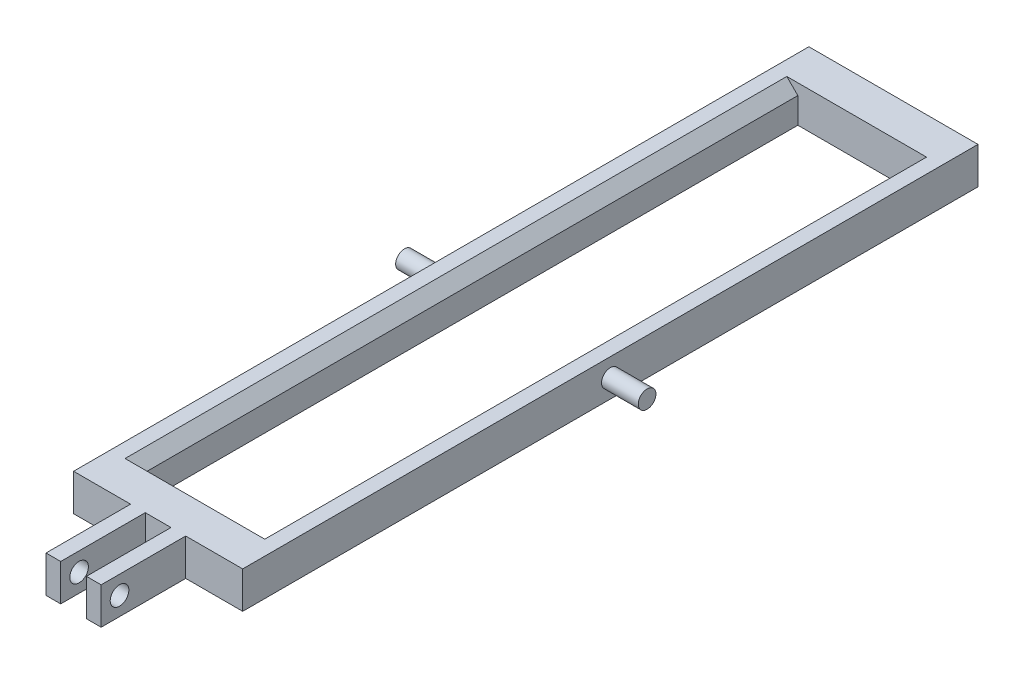
ISO-10303-21;
HEADER;
FILE_DESCRIPTION(('STEP AP214'),'2;1');
FILE_NAME('part.step','',(''),(''),'','','');
FILE_SCHEMA(('AUTOMOTIVE_DESIGN { 1 0 10303 214 1 1 1 1 }'));
ENDSEC;
DATA;
#1=APPLICATION_CONTEXT('core data for automotive mechanical design processes');
#2=APPLICATION_PROTOCOL_DEFINITION('international standard','automotive_design',2000,#1);
#3=PRODUCT_CONTEXT('',#1,'mechanical');
#4=PRODUCT('Part','Part','',(#3));
#5=PRODUCT_RELATED_PRODUCT_CATEGORY('part','',(#4));
#6=PRODUCT_DEFINITION_FORMATION('','',#4);
#7=PRODUCT_DEFINITION_CONTEXT('part definition',#1,'design');
#8=PRODUCT_DEFINITION('design','',#6,#7);
#9=PRODUCT_DEFINITION_SHAPE('','',#8);
#10=(LENGTH_UNIT() NAMED_UNIT(*) SI_UNIT(.MILLI.,.METRE.));
#11=(NAMED_UNIT(*) PLANE_ANGLE_UNIT() SI_UNIT($,.RADIAN.));
#12=(NAMED_UNIT(*) SI_UNIT($,.STERADIAN.) SOLID_ANGLE_UNIT());
#13=UNCERTAINTY_MEASURE_WITH_UNIT(LENGTH_MEASURE(1.E-05),#10,'distance_accuracy_value','');
#14=(GEOMETRIC_REPRESENTATION_CONTEXT(3) GLOBAL_UNCERTAINTY_ASSIGNED_CONTEXT((#13)) GLOBAL_UNIT_ASSIGNED_CONTEXT((#10,
#11,#12)) REPRESENTATION_CONTEXT('',''));
#15=CARTESIAN_POINT('',(0.,0.,0.));
#16=DIRECTION('',(0.,0.,1.));
#17=DIRECTION('',(1.,0.,0.));
#18=AXIS2_PLACEMENT_3D('',#15,#16,#17);
#19=CARTESIAN_POINT('',(0.,0.,200.));
#20=DIRECTION('',(0.,0.,-1.));
#21=DIRECTION('',(-1.,0.,0.));
#22=AXIS2_PLACEMENT_3D('',#19,#20,#21);
#23=PLANE('',#22);
#24=DIRECTION('',(0.,1.,0.));
#25=VECTOR('',#24,1.);
#26=CARTESIAN_POINT('',(19.5,0.,200.));
#27=LINE('',#26,#25);
#28=CARTESIAN_POINT('',(19.5,0.,200.));
#29=VERTEX_POINT('',#28);
#30=CARTESIAN_POINT('',(19.5,10.,200.));
#31=VERTEX_POINT('',#30);
#32=EDGE_CURVE('E58',#29,#31,#27,.T.);
#33=ORIENTED_EDGE('',*,*,#32,.F.);
#34=DIRECTION('',(1.,0.,0.));
#35=VECTOR('',#34,1.);
#36=CARTESIAN_POINT('',(46.,0.,200.));
#37=LINE('',#36,#35);
#38=CARTESIAN_POINT('',(26.5,0.,200.));
#39=VERTEX_POINT('',#38);
#40=EDGE_CURVE('E308',#29,#39,#37,.T.);
#41=ORIENTED_EDGE('',*,*,#40,.T.);
#42=DIRECTION('',(0.,-1.,0.));
#43=VECTOR('',#42,1.);
#44=CARTESIAN_POINT('',(26.5,0.,200.));
#45=LINE('',#44,#43);
#46=CARTESIAN_POINT('',(26.5,10.,200.));
#47=VERTEX_POINT('',#46);
#48=EDGE_CURVE('E51',#47,#39,#45,.T.);
#49=ORIENTED_EDGE('',*,*,#48,.F.);
#50=DIRECTION('',(-1.,0.,0.));
#51=VECTOR('',#50,1.);
#52=CARTESIAN_POINT('',(46.,10.,200.));
#53=LINE('',#52,#51);
#54=EDGE_CURVE('E304',#47,#31,#53,.T.);
#55=ORIENTED_EDGE('',*,*,#54,.T.);
#56=EDGE_LOOP('',(#33,#41,#49,#55));
#57=FACE_BOUND('',#56,.T.);
#58=ADVANCED_FACE('F43',(#57),#23,.F.);
#59=CARTESIAN_POINT('',(0.,0.,200.));
#60=VERTEX_POINT('',#59);
#61=CARTESIAN_POINT('',(15.5,0.,200.));
#62=VERTEX_POINT('',#61);
#63=EDGE_CURVE('E66',#60,#62,#37,.T.);
#64=ORIENTED_EDGE('',*,*,#63,.T.);
#65=DIRECTION('',(0.,1.,0.));
#66=VECTOR('',#65,1.);
#67=CARTESIAN_POINT('',(15.5,0.,200.));
#68=LINE('',#67,#66);
#69=CARTESIAN_POINT('',(15.5,10.,200.));
#70=VERTEX_POINT('',#69);
#71=EDGE_CURVE('E186',#62,#70,#68,.T.);
#72=ORIENTED_EDGE('',*,*,#71,.T.);
#73=CARTESIAN_POINT('',(0.,10.,200.));
#74=VERTEX_POINT('',#73);
#75=EDGE_CURVE('E291',#70,#74,#53,.T.);
#76=ORIENTED_EDGE('',*,*,#75,.T.);
#77=DIRECTION('',(0.,-1.,0.));
#78=VECTOR('',#77,1.);
#79=CARTESIAN_POINT('',(0.,57.0744091837593,200.));
#80=LINE('',#79,#78);
#81=EDGE_CURVE('E267',#74,#60,#80,.T.);
#82=ORIENTED_EDGE('',*,*,#81,.T.);
#83=EDGE_LOOP('',(#64,#72,#76,#82));
#84=FACE_BOUND('',#83,.T.);
#85=ADVANCED_FACE('F340',(#84),#23,.F.);
#86=CARTESIAN_POINT('',(42.,10.,200.));
#87=DIRECTION('',(0.707106781186553,-0.707106781186542,0.));
#88=DIRECTION('',(0.707106781186542,0.707106781186553,0.));
#89=AXIS2_PLACEMENT_3D('',#86,#87,#88);
#90=PLANE('',#89);
#91=DIRECTION('',(0.707106781186542,0.707106781186553,0.));
#92=VECTOR('',#91,1.);
#93=CARTESIAN_POINT('',(42.,10.,10.));
#94=LINE('',#93,#92);
#95=CARTESIAN_POINT('',(39.,6.99999999999997,10.));
#96=VERTEX_POINT('',#95);
#97=CARTESIAN_POINT('',(42.,10.,10.));
#98=VERTEX_POINT('',#97);
#99=EDGE_CURVE('E241',#96,#98,#94,.T.);
#100=ORIENTED_EDGE('',*,*,#99,.F.);
#101=DIRECTION('',(0.,0.,-1.));
#102=VECTOR('',#101,1.);
#103=CARTESIAN_POINT('',(39.,6.99999999999997,200.));
#104=LINE('',#103,#102);
#105=CARTESIAN_POINT('',(39.,6.99999999999997,190.));
#106=VERTEX_POINT('',#105);
#107=EDGE_CURVE('E286',#106,#96,#104,.T.);
#108=ORIENTED_EDGE('',*,*,#107,.F.);
#109=DIRECTION('',(0.707106781186542,0.707106781186553,0.));
#110=VECTOR('',#109,1.);
#111=CARTESIAN_POINT('',(42.,10.,190.));
#112=LINE('',#111,#110);
#113=CARTESIAN_POINT('',(42.,10.,190.));
#114=VERTEX_POINT('',#113);
#115=EDGE_CURVE('E274',#106,#114,#112,.T.);
#116=ORIENTED_EDGE('',*,*,#115,.T.);
#117=DIRECTION('',(0.,0.,-1.));
#118=VECTOR('',#117,1.);
#119=CARTESIAN_POINT('',(42.,10.,200.));
#120=LINE('',#119,#118);
#121=EDGE_CURVE('E284',#114,#98,#120,.T.);
#122=ORIENTED_EDGE('',*,*,#121,.T.);
#123=EDGE_LOOP('',(#100,#108,#116,#122));
#124=FACE_BOUND('',#123,.T.);
#125=ADVANCED_FACE('F365',(#124),#90,.F.);
#126=CARTESIAN_POINT('',(39.,0.,200.));
#127=DIRECTION('',(1.,0.,0.));
#128=DIRECTION('',(0.,1.,0.));
#129=AXIS2_PLACEMENT_3D('',#126,#127,#128);
#130=PLANE('',#129);
#131=DIRECTION('',(0.,1.,0.));
#132=VECTOR('',#131,1.);
#133=CARTESIAN_POINT('',(39.,0.,10.));
#134=LINE('',#133,#132);
#135=CARTESIAN_POINT('',(39.,0.,10.));
#136=VERTEX_POINT('',#135);
#137=EDGE_CURVE('E238',#136,#96,#134,.T.);
#138=ORIENTED_EDGE('',*,*,#137,.F.);
#139=DIRECTION('',(0.,0.,-1.));
#140=VECTOR('',#139,1.);
#141=CARTESIAN_POINT('',(39.,0.,200.));
#142=LINE('',#141,#140);
#143=CARTESIAN_POINT('',(39.,0.,190.));
#144=VERTEX_POINT('',#143);
#145=EDGE_CURVE('E288',#144,#136,#142,.T.);
#146=ORIENTED_EDGE('',*,*,#145,.F.);
#147=DIRECTION('',(0.,1.,0.));
#148=VECTOR('',#147,1.);
#149=CARTESIAN_POINT('',(39.,0.,190.));
#150=LINE('',#149,#148);
#151=EDGE_CURVE('E311',#144,#106,#150,.T.);
#152=ORIENTED_EDGE('',*,*,#151,.T.);
#153=ORIENTED_EDGE('',*,*,#107,.T.);
#154=EDGE_LOOP('',(#138,#146,#152,#153));
#155=FACE_BOUND('',#154,.T.);
#156=ADVANCED_FACE('F386',(#155),#130,.F.);
#157=CARTESIAN_POINT('',(7.,0.,200.));
#158=DIRECTION('',(-1.,0.,0.));
#159=DIRECTION('',(0.,0.,1.));
#160=AXIS2_PLACEMENT_3D('',#157,#158,#159);
#161=PLANE('',#160);
#162=DIRECTION('',(0.,-1.,0.));
#163=VECTOR('',#162,1.);
#164=CARTESIAN_POINT('',(7.,0.,10.));
#165=LINE('',#164,#163);
#166=CARTESIAN_POINT('',(7.,6.99999999999997,10.));
#167=VERTEX_POINT('',#166);
#168=CARTESIAN_POINT('',(7.,0.,10.));
#169=VERTEX_POINT('',#168);
#170=EDGE_CURVE('E234',#167,#169,#165,.T.);
#171=ORIENTED_EDGE('',*,*,#170,.F.);
#172=DIRECTION('',(0.,0.,-1.));
#173=VECTOR('',#172,1.);
#174=CARTESIAN_POINT('',(7.,6.99999999999997,200.));
#175=LINE('',#174,#173);
#176=CARTESIAN_POINT('',(7.,6.99999999999997,190.));
#177=VERTEX_POINT('',#176);
#178=EDGE_CURVE('E253',#177,#167,#175,.T.);
#179=ORIENTED_EDGE('',*,*,#178,.F.);
#180=DIRECTION('',(0.,1.,0.));
#181=VECTOR('',#180,1.);
#182=CARTESIAN_POINT('',(7.,57.0744091837593,190.));
#183=LINE('',#182,#181);
#184=CARTESIAN_POINT('',(7.,0.,190.));
#185=VERTEX_POINT('',#184);
#186=EDGE_CURVE('E317',#185,#177,#183,.T.);
#187=ORIENTED_EDGE('',*,*,#186,.F.);
#188=DIRECTION('',(0.,0.,-1.));
#189=VECTOR('',#188,1.);
#190=CARTESIAN_POINT('',(7.,0.,200.));
#191=LINE('',#190,#189);
#192=EDGE_CURVE('E256',#185,#169,#191,.T.);
#193=ORIENTED_EDGE('',*,*,#192,.T.);
#194=EDGE_LOOP('',(#171,#179,#187,#193));
#195=FACE_BOUND('',#194,.T.);
#196=ADVANCED_FACE('F389',(#195),#161,.F.);
#197=CARTESIAN_POINT('',(4.00000000000001,10.,200.));
#198=DIRECTION('',(-0.707106781186552,-0.707106781186543,0.));
#199=DIRECTION('',(0.707106781186543,-0.707106781186552,0.));
#200=AXIS2_PLACEMENT_3D('',#197,#198,#199);
#201=PLANE('',#200);
#202=DIRECTION('',(0.707106781186543,-0.707106781186552,0.));
#203=VECTOR('',#202,1.);
#204=CARTESIAN_POINT('',(4.00000000000001,10.,10.));
#205=LINE('',#204,#203);
#206=CARTESIAN_POINT('',(4.,10.,10.));
#207=VERTEX_POINT('',#206);
#208=EDGE_CURVE('E320',#207,#167,#205,.T.);
#209=ORIENTED_EDGE('',*,*,#208,.F.);
#210=DIRECTION('',(0.,0.,-1.));
#211=VECTOR('',#210,1.);
#212=CARTESIAN_POINT('',(4.00000000000001,10.,200.));
#213=LINE('',#212,#211);
#214=CARTESIAN_POINT('',(4.00000000000001,10.,190.));
#215=VERTEX_POINT('',#214);
#216=EDGE_CURVE('E250',#215,#207,#213,.T.);
#217=ORIENTED_EDGE('',*,*,#216,.F.);
#218=DIRECTION('',(-0.707106781186543,0.707106781186552,0.));
#219=VECTOR('',#218,1.);
#220=CARTESIAN_POINT('',(-21.5372045918796,35.53720459188,190.));
#221=LINE('',#220,#219);
#222=EDGE_CURVE('E314',#177,#215,#221,.T.);
#223=ORIENTED_EDGE('',*,*,#222,.F.);
#224=ORIENTED_EDGE('',*,*,#178,.T.);
#225=EDGE_LOOP('',(#209,#217,#223,#224));
#226=FACE_BOUND('',#225,.T.);
#227=ADVANCED_FACE('F394',(#226),#201,.F.);
#228=CARTESIAN_POINT('',(0.,57.0744091837593,190.));
#229=DIRECTION('',(0.,0.,-1.));
#230=DIRECTION('',(-1.,0.,0.));
#231=AXIS2_PLACEMENT_3D('',#228,#229,#230);
#232=PLANE('',#231);
#233=ORIENTED_EDGE('',*,*,#222,.T.);
#234=DIRECTION('',(-1.,0.,0.));
#235=VECTOR('',#234,1.);
#236=CARTESIAN_POINT('',(0.,10.,190.));
#237=LINE('',#236,#235);
#238=EDGE_CURVE('E266',#114,#215,#237,.T.);
#239=ORIENTED_EDGE('',*,*,#238,.F.);
#240=ORIENTED_EDGE('',*,*,#115,.F.);
#241=ORIENTED_EDGE('',*,*,#151,.F.);
#242=DIRECTION('',(1.,0.,0.));
#243=VECTOR('',#242,1.);
#244=CARTESIAN_POINT('',(0.,0.,190.));
#245=LINE('',#244,#243);
#246=EDGE_CURVE('E270',#185,#144,#245,.T.);
#247=ORIENTED_EDGE('',*,*,#246,.F.);
#248=ORIENTED_EDGE('',*,*,#186,.T.);
#249=EDGE_LOOP('',(#233,#239,#240,#241,#247,#248));
#250=FACE_BOUND('',#249,.T.);
#251=ADVANCED_FACE('F412',(#250),#232,.T.);
#252=CARTESIAN_POINT('',(46.,0.,200.));
#253=DIRECTION('',(0.,1.,0.));
#254=DIRECTION('',(0.,0.,1.));
#255=AXIS2_PLACEMENT_3D('',#252,#253,#254);
#256=PLANE('',#255);
#257=ORIENTED_EDGE('',*,*,#40,.F.);
#258=DIRECTION('',(0.,0.,-1.));
#259=VECTOR('',#258,1.);
#260=CARTESIAN_POINT('',(19.5,0.,223.));
#261=LINE('',#260,#259);
#262=CARTESIAN_POINT('',(19.5,0.,223.));
#263=VERTEX_POINT('',#262);
#264=EDGE_CURVE('E174',#263,#29,#261,.T.);
#265=ORIENTED_EDGE('',*,*,#264,.F.);
#266=DIRECTION('',(1.,0.,0.));
#267=VECTOR('',#266,1.);
#268=CARTESIAN_POINT('',(15.5,0.,223.));
#269=LINE('',#268,#267);
#270=CARTESIAN_POINT('',(15.5,0.,223.));
#271=VERTEX_POINT('',#270);
#272=EDGE_CURVE('E168',#271,#263,#269,.T.);
#273=ORIENTED_EDGE('',*,*,#272,.F.);
#274=DIRECTION('',(0.,0.,-1.));
#275=VECTOR('',#274,1.);
#276=CARTESIAN_POINT('',(15.5,0.,223.));
#277=LINE('',#276,#275);
#278=EDGE_CURVE('E172',#271,#62,#277,.T.);
#279=ORIENTED_EDGE('',*,*,#278,.T.);
#280=ORIENTED_EDGE('',*,*,#63,.F.);
#281=DIRECTION('',(0.,0.,-1.));
#282=VECTOR('',#281,1.);
#283=CARTESIAN_POINT('',(0.,0.,200.));
#284=LINE('',#283,#282);
#285=CARTESIAN_POINT('',(0.,0.,0.));
#286=VERTEX_POINT('',#285);
#287=EDGE_CURVE('E262',#60,#286,#284,.T.);
#288=ORIENTED_EDGE('',*,*,#287,.T.);
#289=DIRECTION('',(1.,0.,0.));
#290=VECTOR('',#289,1.);
#291=CARTESIAN_POINT('',(46.,0.,0.));
#292=LINE('',#291,#290);
#293=CARTESIAN_POINT('',(46.,0.,0.));
#294=VERTEX_POINT('',#293);
#295=EDGE_CURVE('E297',#286,#294,#292,.T.);
#296=ORIENTED_EDGE('',*,*,#295,.T.);
#297=DIRECTION('',(0.,0.,-1.));
#298=VECTOR('',#297,1.);
#299=CARTESIAN_POINT('',(46.,0.,200.));
#300=LINE('',#299,#298);
#301=CARTESIAN_POINT('',(46.,0.,200.));
#302=VERTEX_POINT('',#301);
#303=EDGE_CURVE('E280',#302,#294,#300,.T.);
#304=ORIENTED_EDGE('',*,*,#303,.F.);
#305=CARTESIAN_POINT('',(30.5,0.,200.));
#306=VERTEX_POINT('',#305);
#307=EDGE_CURVE('E306',#306,#302,#37,.T.);
#308=ORIENTED_EDGE('',*,*,#307,.F.);
#309=DIRECTION('',(0.,0.,-1.));
#310=VECTOR('',#309,1.);
#311=CARTESIAN_POINT('',(30.5,0.,223.));
#312=LINE('',#311,#310);
#313=CARTESIAN_POINT('',(30.5,0.,223.));
#314=VERTEX_POINT('',#313);
#315=EDGE_CURVE('E217',#314,#306,#312,.T.);
#316=ORIENTED_EDGE('',*,*,#315,.F.);
#317=DIRECTION('',(-1.,0.,0.));
#318=VECTOR('',#317,1.);
#319=CARTESIAN_POINT('',(30.5,0.,223.));
#320=LINE('',#319,#318);
#321=CARTESIAN_POINT('',(26.5,0.,223.));
#322=VERTEX_POINT('',#321);
#323=EDGE_CURVE('E220',#314,#322,#320,.T.);
#324=ORIENTED_EDGE('',*,*,#323,.T.);
#325=DIRECTION('',(0.,0.,-1.));
#326=VECTOR('',#325,1.);
#327=CARTESIAN_POINT('',(26.5,0.,223.));
#328=LINE('',#327,#326);
#329=EDGE_CURVE('E215',#322,#39,#328,.T.);
#330=ORIENTED_EDGE('',*,*,#329,.T.);
#331=EDGE_LOOP('',(#257,#265,#273,#279,#280,#288,#296,#304,#308,#316,#324,#330));
#332=FACE_BOUND('',#331,.T.);
#333=ORIENTED_EDGE('',*,*,#246,.T.);
#334=ORIENTED_EDGE('',*,*,#145,.T.);
#335=DIRECTION('',(1.,0.,0.));
#336=VECTOR('',#335,1.);
#337=CARTESIAN_POINT('',(0.,0.,10.));
#338=LINE('',#337,#336);
#339=EDGE_CURVE('E231',#169,#136,#338,.T.);
#340=ORIENTED_EDGE('',*,*,#339,.F.);
#341=ORIENTED_EDGE('',*,*,#192,.F.);
#342=EDGE_LOOP('',(#333,#334,#340,#341));
#343=FACE_BOUND('',#342,.T.);
#344=ADVANCED_FACE('F170',(#332,#343),#256,.F.);
#345=CARTESIAN_POINT('',(46.,0.,200.));
#346=DIRECTION('',(-1.,0.,0.));
#347=DIRECTION('',(0.,-1.,0.));
#348=AXIS2_PLACEMENT_3D('',#345,#346,#347);
#349=PLANE('',#348);
#350=DIRECTION('',(0.,1.,0.));
#351=VECTOR('',#350,1.);
#352=CARTESIAN_POINT('',(46.,0.,0.));
#353=LINE('',#352,#351);
#354=CARTESIAN_POINT('',(46.,10.,0.));
#355=VERTEX_POINT('',#354);
#356=EDGE_CURVE('E294',#294,#355,#353,.T.);
#357=ORIENTED_EDGE('',*,*,#356,.T.);
#358=DIRECTION('',(0.,0.,-1.));
#359=VECTOR('',#358,1.);
#360=CARTESIAN_POINT('',(46.,10.,200.));
#361=LINE('',#360,#359);
#362=CARTESIAN_POINT('',(46.,10.,200.));
#363=VERTEX_POINT('',#362);
#364=EDGE_CURVE('E282',#363,#355,#361,.T.);
#365=ORIENTED_EDGE('',*,*,#364,.F.);
#366=DIRECTION('',(0.,1.,0.));
#367=VECTOR('',#366,1.);
#368=CARTESIAN_POINT('',(46.,0.,200.));
#369=LINE('',#368,#367);
#370=EDGE_CURVE('E303',#302,#363,#369,.T.);
#371=ORIENTED_EDGE('',*,*,#370,.F.);
#372=ORIENTED_EDGE('',*,*,#303,.T.);
#373=EDGE_LOOP('',(#357,#365,#371,#372));
#374=FACE_BOUND('',#373,.T.);
#375=CARTESIAN_POINT('',(46.,5.00000000000003,100.));
#376=DIRECTION('',(-1.,0.,0.));
#377=DIRECTION('',(0.,-1.,0.));
#378=AXIS2_PLACEMENT_3D('',#375,#376,#377);
#379=CIRCLE('',#378,2.4);
#380=CARTESIAN_POINT('',(46.,2.60000000000003,100.));
#381=VERTEX_POINT('',#380);
#382=EDGE_CURVE('E300',#381,#381,#379,.F.);
#383=ORIENTED_EDGE('',*,*,#382,.F.);
#384=EDGE_LOOP('',(#383));
#385=FACE_BOUND('',#384,.T.);
#386=ADVANCED_FACE('F355',(#374,#385),#349,.F.);
#387=CARTESIAN_POINT('',(46.,10.,200.));
#388=DIRECTION('',(0.,-1.,0.));
#389=DIRECTION('',(0.,0.,-1.));
#390=AXIS2_PLACEMENT_3D('',#387,#388,#389);
#391=PLANE('',#390);
#392=ORIENTED_EDGE('',*,*,#238,.T.);
#393=ORIENTED_EDGE('',*,*,#216,.T.);
#394=DIRECTION('',(-1.,0.,0.));
#395=VECTOR('',#394,1.);
#396=CARTESIAN_POINT('',(0.,10.,10.));
#397=LINE('',#396,#395);
#398=EDGE_CURVE('E232',#98,#207,#397,.T.);
#399=ORIENTED_EDGE('',*,*,#398,.F.);
#400=ORIENTED_EDGE('',*,*,#121,.F.);
#401=EDGE_LOOP('',(#392,#393,#399,#400));
#402=FACE_BOUND('',#401,.T.);
#403=ORIENTED_EDGE('',*,*,#75,.F.);
#404=DIRECTION('',(0.,0.,1.));
#405=VECTOR('',#404,1.);
#406=CARTESIAN_POINT('',(15.5,10.,190.));
#407=LINE('',#406,#405);
#408=CARTESIAN_POINT('',(15.5,9.99999999999998,223.));
#409=VERTEX_POINT('',#408);
#410=EDGE_CURVE('E192',#70,#409,#407,.T.);
#411=ORIENTED_EDGE('',*,*,#410,.T.);
#412=DIRECTION('',(1.,0.,0.));
#413=VECTOR('',#412,1.);
#414=CARTESIAN_POINT('',(15.5,9.99999999999998,223.));
#415=LINE('',#414,#413);
#416=CARTESIAN_POINT('',(19.5,9.99999999999999,223.));
#417=VERTEX_POINT('',#416);
#418=EDGE_CURVE('E179',#409,#417,#415,.T.);
#419=ORIENTED_EDGE('',*,*,#418,.T.);
#420=DIRECTION('',(0.,0.,1.));
#421=VECTOR('',#420,1.);
#422=CARTESIAN_POINT('',(19.5,10.,190.));
#423=LINE('',#422,#421);
#424=EDGE_CURVE('E187',#31,#417,#423,.T.);
#425=ORIENTED_EDGE('',*,*,#424,.F.);
#426=ORIENTED_EDGE('',*,*,#54,.F.);
#427=DIRECTION('',(0.,0.,1.));
#428=VECTOR('',#427,1.);
#429=CARTESIAN_POINT('',(26.5,10.,190.));
#430=LINE('',#429,#428);
#431=CARTESIAN_POINT('',(26.5,9.99999999999999,223.));
#432=VERTEX_POINT('',#431);
#433=EDGE_CURVE('E209',#47,#432,#430,.T.);
#434=ORIENTED_EDGE('',*,*,#433,.T.);
#435=DIRECTION('',(-1.,0.,0.));
#436=VECTOR('',#435,1.);
#437=CARTESIAN_POINT('',(30.5,9.99999999999999,223.));
#438=LINE('',#437,#436);
#439=CARTESIAN_POINT('',(30.5,9.99999999999999,223.));
#440=VERTEX_POINT('',#439);
#441=EDGE_CURVE('E228',#440,#432,#438,.T.);
#442=ORIENTED_EDGE('',*,*,#441,.F.);
#443=DIRECTION('',(0.,0.,1.));
#444=VECTOR('',#443,1.);
#445=CARTESIAN_POINT('',(30.5,10.,190.));
#446=LINE('',#445,#444);
#447=CARTESIAN_POINT('',(30.5,10.,200.));
#448=VERTEX_POINT('',#447);
#449=EDGE_CURVE('E212',#448,#440,#446,.T.);
#450=ORIENTED_EDGE('',*,*,#449,.F.);
#451=EDGE_CURVE('E301',#363,#448,#53,.T.);
#452=ORIENTED_EDGE('',*,*,#451,.F.);
#453=ORIENTED_EDGE('',*,*,#364,.T.);
#454=DIRECTION('',(-1.,0.,0.));
#455=VECTOR('',#454,1.);
#456=CARTESIAN_POINT('',(46.,10.,0.));
#457=LINE('',#456,#455);
#458=CARTESIAN_POINT('',(0.,10.,0.));
#459=VERTEX_POINT('',#458);
#460=EDGE_CURVE('E292',#355,#459,#457,.T.);
#461=ORIENTED_EDGE('',*,*,#460,.T.);
#462=DIRECTION('',(0.,0.,1.));
#463=VECTOR('',#462,1.);
#464=CARTESIAN_POINT('',(0.,10.,200.));
#465=LINE('',#464,#463);
#466=EDGE_CURVE('E263',#459,#74,#465,.T.);
#467=ORIENTED_EDGE('',*,*,#466,.T.);
#468=EDGE_LOOP('',(#403,#411,#419,#425,#426,#434,#442,#450,#452,#453,#461,#467));
#469=FACE_BOUND('',#468,.T.);
#470=ADVANCED_FACE('F337',(#402,#469),#391,.F.);
#471=ORIENTED_EDGE('',*,*,#451,.T.);
#472=DIRECTION('',(0.,-1.,0.));
#473=VECTOR('',#472,1.);
#474=CARTESIAN_POINT('',(30.5,0.,200.));
#475=LINE('',#474,#473);
#476=EDGE_CURVE('E11',#448,#306,#475,.T.);
#477=ORIENTED_EDGE('',*,*,#476,.T.);
#478=ORIENTED_EDGE('',*,*,#307,.T.);
#479=ORIENTED_EDGE('',*,*,#370,.T.);
#480=EDGE_LOOP('',(#471,#477,#478,#479));
#481=FACE_BOUND('',#480,.T.);
#482=ADVANCED_FACE('F45',(#481),#23,.F.);
#483=CARTESIAN_POINT('',(0.,0.,0.));
#484=DIRECTION('',(0.,0.,-1.));
#485=DIRECTION('',(-1.,0.,0.));
#486=AXIS2_PLACEMENT_3D('',#483,#484,#485);
#487=PLANE('',#486);
#488=ORIENTED_EDGE('',*,*,#295,.F.);
#489=DIRECTION('',(0.,-1.,0.));
#490=VECTOR('',#489,1.);
#491=CARTESIAN_POINT('',(0.,0.,0.));
#492=LINE('',#491,#490);
#493=EDGE_CURVE('E247',#459,#286,#492,.T.);
#494=ORIENTED_EDGE('',*,*,#493,.F.);
#495=ORIENTED_EDGE('',*,*,#460,.F.);
#496=ORIENTED_EDGE('',*,*,#356,.F.);
#497=EDGE_LOOP('',(#488,#494,#495,#496));
#498=FACE_BOUND('',#497,.T.);
#499=ADVANCED_FACE('F352',(#498),#487,.T.);
#500=CARTESIAN_POINT('',(56.,5.00000000000004,100.));
#501=DIRECTION('',(-1.,0.,0.));
#502=DIRECTION('',(0.,-1.,0.));
#503=AXIS2_PLACEMENT_3D('',#500,#501,#502);
#504=CYLINDRICAL_SURFACE('',#503,2.4);
#505=CARTESIAN_POINT('',(56.,5.00000000000004,100.));
#506=DIRECTION('',(1.,0.,0.));
#507=DIRECTION('',(0.,1.,0.));
#508=AXIS2_PLACEMENT_3D('',#505,#506,#507);
#509=CIRCLE('',#508,2.4);
#510=CARTESIAN_POINT('',(56.,7.40000000000004,100.));
#511=VERTEX_POINT('',#510);
#512=EDGE_CURVE('E277',#511,#511,#509,.T.);
#513=ORIENTED_EDGE('',*,*,#512,.F.);
#514=EDGE_LOOP('',(#513));
#515=FACE_BOUND('',#514,.T.);
#516=ORIENTED_EDGE('',*,*,#382,.T.);
#517=EDGE_LOOP('',(#516));
#518=FACE_BOUND('',#517,.T.);
#519=ADVANCED_FACE('F372',(#515,#518),#504,.T.);
#520=CARTESIAN_POINT('',(56.,5.00000000000004,100.));
#521=DIRECTION('',(1.,0.,0.));
#522=DIRECTION('',(0.,1.,0.));
#523=AXIS2_PLACEMENT_3D('',#520,#521,#522);
#524=PLANE('',#523);
#525=ORIENTED_EDGE('',*,*,#512,.T.);
#526=EDGE_LOOP('',(#525));
#527=FACE_BOUND('',#526,.T.);
#528=ADVANCED_FACE('F425',(#527),#524,.T.);
#529=CARTESIAN_POINT('',(0.,57.0744091837593,200.));
#530=DIRECTION('',(-1.,0.,0.));
#531=DIRECTION('',(0.,0.,1.));
#532=AXIS2_PLACEMENT_3D('',#529,#530,#531);
#533=PLANE('',#532);
#534=ORIENTED_EDGE('',*,*,#493,.T.);
#535=ORIENTED_EDGE('',*,*,#287,.F.);
#536=ORIENTED_EDGE('',*,*,#81,.F.);
#537=ORIENTED_EDGE('',*,*,#466,.F.);
#538=EDGE_LOOP('',(#534,#535,#536,#537));
#539=FACE_BOUND('',#538,.T.);
#540=CARTESIAN_POINT('',(0.,5.00000000000004,100.));
#541=DIRECTION('',(1.,0.,0.));
#542=DIRECTION('',(0.,0.,-1.));
#543=AXIS2_PLACEMENT_3D('',#540,#541,#542);
#544=CIRCLE('',#543,2.4);
#545=CARTESIAN_POINT('',(0.,5.00000000000004,97.6));
#546=VERTEX_POINT('',#545);
#547=EDGE_CURVE('E259',#546,#546,#544,.F.);
#548=ORIENTED_EDGE('',*,*,#547,.F.);
#549=EDGE_LOOP('',(#548));
#550=FACE_BOUND('',#549,.T.);
#551=ADVANCED_FACE('F347',(#539,#550),#533,.T.);
#552=CARTESIAN_POINT('',(-10.,5.00000000000004,100.));
#553=DIRECTION('',(1.,0.,0.));
#554=DIRECTION('',(0.,0.,-1.));
#555=AXIS2_PLACEMENT_3D('',#552,#553,#554);
#556=CYLINDRICAL_SURFACE('',#555,2.4);
#557=CARTESIAN_POINT('',(-10.,5.00000000000004,100.));
#558=DIRECTION('',(-1.,0.,0.));
#559=DIRECTION('',(0.,0.,1.));
#560=AXIS2_PLACEMENT_3D('',#557,#558,#559);
#561=CIRCLE('',#560,2.4);
#562=CARTESIAN_POINT('',(-10.,5.00000000000004,102.4));
#563=VERTEX_POINT('',#562);
#564=EDGE_CURVE('E244',#563,#563,#561,.T.);
#565=ORIENTED_EDGE('',*,*,#564,.F.);
#566=EDGE_LOOP('',(#565));
#567=FACE_BOUND('',#566,.T.);
#568=ORIENTED_EDGE('',*,*,#547,.T.);
#569=EDGE_LOOP('',(#568));
#570=FACE_BOUND('',#569,.T.);
#571=ADVANCED_FACE('F424',(#567,#570),#556,.T.);
#572=CARTESIAN_POINT('',(-10.,5.00000000000004,100.));
#573=DIRECTION('',(-1.,0.,0.));
#574=DIRECTION('',(0.,0.,1.));
#575=AXIS2_PLACEMENT_3D('',#572,#573,#574);
#576=PLANE('',#575);
#577=ORIENTED_EDGE('',*,*,#564,.T.);
#578=EDGE_LOOP('',(#577));
#579=FACE_BOUND('',#578,.T.);
#580=ADVANCED_FACE('F450',(#579),#576,.T.);
#581=CARTESIAN_POINT('',(0.,57.0744091837593,10.));
#582=DIRECTION('',(0.,0.,-1.));
#583=DIRECTION('',(-1.,0.,0.));
#584=AXIS2_PLACEMENT_3D('',#581,#582,#583);
#585=PLANE('',#584);
#586=ORIENTED_EDGE('',*,*,#137,.T.);
#587=ORIENTED_EDGE('',*,*,#99,.T.);
#588=ORIENTED_EDGE('',*,*,#398,.T.);
#589=ORIENTED_EDGE('',*,*,#208,.T.);
#590=ORIENTED_EDGE('',*,*,#170,.T.);
#591=ORIENTED_EDGE('',*,*,#339,.T.);
#592=EDGE_LOOP('',(#586,#587,#588,#589,#590,#591));
#593=FACE_BOUND('',#592,.T.);
#594=ADVANCED_FACE('F405',(#593),#585,.F.);
#595=CARTESIAN_POINT('',(30.5,0.,0.));
#596=DIRECTION('',(1.,0.,0.));
#597=DIRECTION('',(0.,1.,0.));
#598=AXIS2_PLACEMENT_3D('',#595,#596,#597);
#599=PLANE('',#598);
#600=CARTESIAN_POINT('',(30.5,4.99999999999999,218.));
#601=DIRECTION('',(1.,0.,0.));
#602=DIRECTION('',(0.,1.,0.));
#603=AXIS2_PLACEMENT_3D('',#600,#601,#602);
#604=CIRCLE('',#603,2.53500000000002);
#605=CARTESIAN_POINT('',(30.5,7.53500000000001,218.));
#606=VERTEX_POINT('',#605);
#607=EDGE_CURVE('E206',#606,#606,#604,.T.);
#608=ORIENTED_EDGE('',*,*,#607,.F.);
#609=EDGE_LOOP('',(#608));
#610=FACE_BOUND('',#609,.T.);
#611=ORIENTED_EDGE('',*,*,#476,.F.);
#612=ORIENTED_EDGE('',*,*,#449,.T.);
#613=DIRECTION('',(0.,-1.,0.));
#614=VECTOR('',#613,1.);
#615=CARTESIAN_POINT('',(30.5,9.99999999999999,223.));
#616=LINE('',#615,#614);
#617=EDGE_CURVE('E214',#440,#314,#616,.T.);
#618=ORIENTED_EDGE('',*,*,#617,.T.);
#619=ORIENTED_EDGE('',*,*,#315,.T.);
#620=EDGE_LOOP('',(#611,#612,#618,#619));
#621=FACE_BOUND('',#620,.T.);
#622=ADVANCED_FACE('F475',(#610,#621),#599,.T.);
#623=CARTESIAN_POINT('',(26.5,0.,0.));
#624=DIRECTION('',(1.,0.,0.));
#625=DIRECTION('',(0.,1.,0.));
#626=AXIS2_PLACEMENT_3D('',#623,#624,#625);
#627=PLANE('',#626);
#628=CARTESIAN_POINT('',(26.5,4.99999999999999,218.));
#629=DIRECTION('',(1.,0.,0.));
#630=DIRECTION('',(0.,1.,0.));
#631=AXIS2_PLACEMENT_3D('',#628,#629,#630);
#632=CIRCLE('',#631,2.53500000000002);
#633=CARTESIAN_POINT('',(26.5,7.53500000000001,218.));
#634=VERTEX_POINT('',#633);
#635=EDGE_CURVE('E205',#634,#634,#632,.T.);
#636=ORIENTED_EDGE('',*,*,#635,.T.);
#637=EDGE_LOOP('',(#636));
#638=FACE_BOUND('',#637,.T.);
#639=ORIENTED_EDGE('',*,*,#433,.F.);
#640=ORIENTED_EDGE('',*,*,#48,.T.);
#641=ORIENTED_EDGE('',*,*,#329,.F.);
#642=DIRECTION('',(0.,-1.,0.));
#643=VECTOR('',#642,1.);
#644=CARTESIAN_POINT('',(26.5,9.99999999999999,223.));
#645=LINE('',#644,#643);
#646=EDGE_CURVE('E222',#432,#322,#645,.T.);
#647=ORIENTED_EDGE('',*,*,#646,.F.);
#648=EDGE_LOOP('',(#639,#640,#641,#647));
#649=FACE_BOUND('',#648,.T.);
#650=ADVANCED_FACE('F325',(#638,#649),#627,.F.);
#651=CARTESIAN_POINT('',(30.5,9.99999999999999,223.));
#652=DIRECTION('',(0.,0.,-1.));
#653=DIRECTION('',(-1.,0.,0.));
#654=AXIS2_PLACEMENT_3D('',#651,#652,#653);
#655=PLANE('',#654);
#656=ORIENTED_EDGE('',*,*,#646,.T.);
#657=ORIENTED_EDGE('',*,*,#323,.F.);
#658=ORIENTED_EDGE('',*,*,#617,.F.);
#659=ORIENTED_EDGE('',*,*,#441,.T.);
#660=EDGE_LOOP('',(#656,#657,#658,#659));
#661=FACE_BOUND('',#660,.T.);
#662=ADVANCED_FACE('F332',(#661),#655,.F.);
#663=CARTESIAN_POINT('',(30.5,4.99999999999999,218.));
#664=DIRECTION('',(-1.,0.,0.));
#665=DIRECTION('',(0.,-1.,0.));
#666=AXIS2_PLACEMENT_3D('',#663,#664,#665);
#667=CYLINDRICAL_SURFACE('',#666,2.53500000000002);
#668=ORIENTED_EDGE('',*,*,#607,.T.);
#669=EDGE_LOOP('',(#668));
#670=FACE_BOUND('',#669,.T.);
#671=ORIENTED_EDGE('',*,*,#635,.F.);
#672=EDGE_LOOP('',(#671));
#673=FACE_BOUND('',#672,.T.);
#674=ADVANCED_FACE('F508',(#670,#673),#667,.F.);
#675=CARTESIAN_POINT('',(15.5,0.,0.));
#676=DIRECTION('',(-1.,0.,0.));
#677=DIRECTION('',(0.,1.,0.));
#678=AXIS2_PLACEMENT_3D('',#675,#676,#677);
#679=PLANE('',#678);
#680=CARTESIAN_POINT('',(15.5,4.99999999999999,218.));
#681=DIRECTION('',(1.,0.,0.));
#682=DIRECTION('',(0.,1.,0.));
#683=AXIS2_PLACEMENT_3D('',#680,#681,#682);
#684=CIRCLE('',#683,2.53500000000002);
#685=CARTESIAN_POINT('',(15.5,7.535,218.));
#686=VERTEX_POINT('',#685);
#687=EDGE_CURVE('E199',#686,#686,#684,.T.);
#688=ORIENTED_EDGE('',*,*,#687,.T.);
#689=EDGE_LOOP('',(#688));
#690=FACE_BOUND('',#689,.T.);
#691=ORIENTED_EDGE('',*,*,#71,.F.);
#692=ORIENTED_EDGE('',*,*,#278,.F.);
#693=DIRECTION('',(0.,-1.,0.));
#694=VECTOR('',#693,1.);
#695=CARTESIAN_POINT('',(15.5,9.99999999999998,223.));
#696=LINE('',#695,#694);
#697=EDGE_CURVE('E185',#409,#271,#696,.T.);
#698=ORIENTED_EDGE('',*,*,#697,.F.);
#699=ORIENTED_EDGE('',*,*,#410,.F.);
#700=EDGE_LOOP('',(#691,#692,#698,#699));
#701=FACE_BOUND('',#700,.T.);
#702=ADVANCED_FACE('F183',(#690,#701),#679,.T.);
#703=CARTESIAN_POINT('',(19.5,0.,0.));
#704=DIRECTION('',(-1.,0.,0.));
#705=DIRECTION('',(0.,1.,0.));
#706=AXIS2_PLACEMENT_3D('',#703,#704,#705);
#707=PLANE('',#706);
#708=CARTESIAN_POINT('',(19.5,4.99999999999999,218.));
#709=DIRECTION('',(1.,0.,0.));
#710=DIRECTION('',(0.,1.,0.));
#711=AXIS2_PLACEMENT_3D('',#708,#709,#710);
#712=CIRCLE('',#711,2.53500000000002);
#713=CARTESIAN_POINT('',(19.5,7.53500000000001,218.));
#714=VERTEX_POINT('',#713);
#715=EDGE_CURVE('E564',#714,#714,#712,.T.);
#716=ORIENTED_EDGE('',*,*,#715,.F.);
#717=EDGE_LOOP('',(#716));
#718=FACE_BOUND('',#717,.T.);
#719=ORIENTED_EDGE('',*,*,#264,.T.);
#720=ORIENTED_EDGE('',*,*,#32,.T.);
#721=ORIENTED_EDGE('',*,*,#424,.T.);
#722=DIRECTION('',(0.,-1.,0.));
#723=VECTOR('',#722,1.);
#724=CARTESIAN_POINT('',(19.5,9.99999999999999,223.));
#725=LINE('',#724,#723);
#726=EDGE_CURVE('E198',#417,#263,#725,.T.);
#727=ORIENTED_EDGE('',*,*,#726,.T.);
#728=EDGE_LOOP('',(#719,#720,#721,#727));
#729=FACE_BOUND('',#728,.T.);
#730=ADVANCED_FACE('F527',(#718,#729),#707,.F.);
#731=CARTESIAN_POINT('',(15.5,9.99999999999998,223.));
#732=DIRECTION('',(0.,0.,1.));
#733=DIRECTION('',(1.,0.,0.));
#734=AXIS2_PLACEMENT_3D('',#731,#732,#733);
#735=PLANE('',#734);
#736=ORIENTED_EDGE('',*,*,#726,.F.);
#737=ORIENTED_EDGE('',*,*,#418,.F.);
#738=ORIENTED_EDGE('',*,*,#697,.T.);
#739=ORIENTED_EDGE('',*,*,#272,.T.);
#740=EDGE_LOOP('',(#736,#737,#738,#739));
#741=FACE_BOUND('',#740,.T.);
#742=ADVANCED_FACE('F190',(#741),#735,.T.);
#743=CARTESIAN_POINT('',(15.5,4.99999999999999,218.));
#744=DIRECTION('',(1.,0.,0.));
#745=DIRECTION('',(0.,1.,0.));
#746=AXIS2_PLACEMENT_3D('',#743,#744,#745);
#747=CYLINDRICAL_SURFACE('',#746,2.53500000000002);
#748=ORIENTED_EDGE('',*,*,#687,.F.);
#749=EDGE_LOOP('',(#748));
#750=FACE_BOUND('',#749,.T.);
#751=ORIENTED_EDGE('',*,*,#715,.T.);
#752=EDGE_LOOP('',(#751));
#753=FACE_BOUND('',#752,.T.);
#754=ADVANCED_FACE('F544',(#750,#753),#747,.F.);
#755=CLOSED_SHELL('',(#58,#85,#125,#156,#196,#227,#251,#344,#386,#470,#482,#499,#519,#528,#551,
#571,#580,#594,#622,#650,#662,#674,#702,#730,#742,#754));
#756=MANIFOLD_SOLID_BREP('B2',#755);
#757=ADVANCED_BREP_SHAPE_REPRESENTATION('',(#18,#756),#14);
#758=SHAPE_DEFINITION_REPRESENTATION(#9,#757);
ENDSEC;
END-ISO-10303-21;
